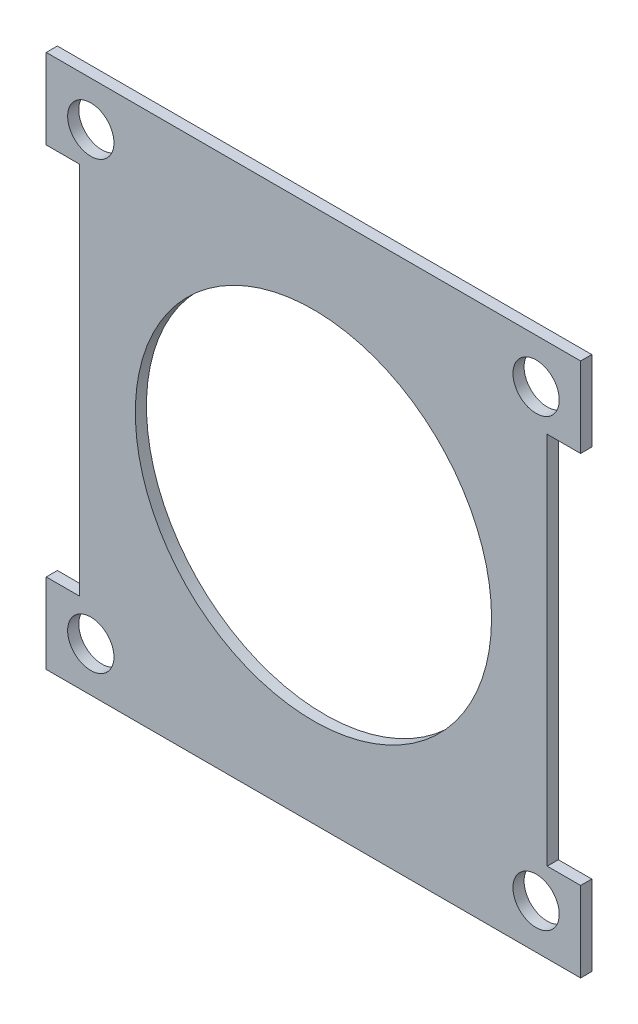
ISO-10303-21;
HEADER;
FILE_DESCRIPTION(('STEP AP214'),'2;1');
FILE_NAME('part.step','',(''),(''),'','','');
FILE_SCHEMA(('AUTOMOTIVE_DESIGN { 1 0 10303 214 1 1 1 1 }'));
ENDSEC;
DATA;
#1=APPLICATION_CONTEXT('core data for automotive mechanical design processes');
#2=APPLICATION_PROTOCOL_DEFINITION('international standard','automotive_design',2000,#1);
#3=PRODUCT_CONTEXT('',#1,'mechanical');
#4=PRODUCT('Part','Part','',(#3));
#5=PRODUCT_RELATED_PRODUCT_CATEGORY('part','',(#4));
#6=PRODUCT_DEFINITION_FORMATION('','',#4);
#7=PRODUCT_DEFINITION_CONTEXT('part definition',#1,'design');
#8=PRODUCT_DEFINITION('design','',#6,#7);
#9=PRODUCT_DEFINITION_SHAPE('','',#8);
#10=(LENGTH_UNIT() NAMED_UNIT(*) SI_UNIT(.MILLI.,.METRE.));
#11=(NAMED_UNIT(*) PLANE_ANGLE_UNIT() SI_UNIT($,.RADIAN.));
#12=(NAMED_UNIT(*) SI_UNIT($,.STERADIAN.) SOLID_ANGLE_UNIT());
#13=UNCERTAINTY_MEASURE_WITH_UNIT(LENGTH_MEASURE(1.E-05),#10,'distance_accuracy_value','');
#14=(GEOMETRIC_REPRESENTATION_CONTEXT(3) GLOBAL_UNCERTAINTY_ASSIGNED_CONTEXT((#13)) GLOBAL_UNIT_ASSIGNED_CONTEXT((#10,
#11,#12)) REPRESENTATION_CONTEXT('',''));
#15=CARTESIAN_POINT('',(0.,0.,0.));
#16=DIRECTION('',(0.,0.,1.));
#17=DIRECTION('',(1.,0.,0.));
#18=AXIS2_PLACEMENT_3D('',#15,#16,#17);
#19=CARTESIAN_POINT('',(0.,0.,1.5875));
#20=DIRECTION('',(0.,0.,1.));
#21=DIRECTION('',(1.,0.,0.));
#22=AXIS2_PLACEMENT_3D('',#19,#20,#21);
#23=PLANE('',#22);
#24=CARTESIAN_POINT('',(-31.75,-31.7499999999996,1.5875));
#25=DIRECTION('',(0.,0.,-1.));
#26=DIRECTION('',(1.,0.,0.));
#27=AXIS2_PLACEMENT_3D('',#24,#25,#26);
#28=CIRCLE('',#27,3.302);
#29=CARTESIAN_POINT('',(-28.448,-31.7499999999996,1.5875));
#30=VERTEX_POINT('',#29);
#31=EDGE_CURVE('E177',#30,#30,#28,.T.);
#32=ORIENTED_EDGE('',*,*,#31,.T.);
#33=EDGE_LOOP('',(#32));
#34=FACE_BOUND('',#33,.T.);
#35=CARTESIAN_POINT('',(31.75,-31.7499999999996,1.5875));
#36=DIRECTION('',(0.,0.,1.));
#37=DIRECTION('',(-1.,0.,0.));
#38=AXIS2_PLACEMENT_3D('',#35,#36,#37);
#39=CIRCLE('',#38,3.302);
#40=CARTESIAN_POINT('',(28.448,-31.7499999999996,1.5875));
#41=VERTEX_POINT('',#40);
#42=EDGE_CURVE('E185',#41,#41,#39,.T.);
#43=ORIENTED_EDGE('',*,*,#42,.F.);
#44=EDGE_LOOP('',(#43));
#45=FACE_BOUND('',#44,.T.);
#46=CARTESIAN_POINT('',(0.,0.,1.5875));
#47=DIRECTION('',(0.,0.,1.));
#48=DIRECTION('',(1.,0.,0.));
#49=AXIS2_PLACEMENT_3D('',#46,#47,#48);
#50=CIRCLE('',#49,25.4);
#51=CARTESIAN_POINT('',(25.4,0.,1.5875));
#52=VERTEX_POINT('',#51);
#53=EDGE_CURVE('E197',#52,#52,#50,.T.);
#54=ORIENTED_EDGE('',*,*,#53,.F.);
#55=EDGE_LOOP('',(#54));
#56=FACE_BOUND('',#55,.T.);
#57=CARTESIAN_POINT('',(-31.75,31.7499999999996,1.5875));
#58=DIRECTION('',(0.,0.,1.));
#59=DIRECTION('',(1.,0.,0.));
#60=AXIS2_PLACEMENT_3D('',#57,#58,#59);
#61=CIRCLE('',#60,3.302);
#62=CARTESIAN_POINT('',(-28.448,31.7499999999996,1.5875));
#63=VERTEX_POINT('',#62);
#64=EDGE_CURVE('E193',#63,#63,#61,.T.);
#65=ORIENTED_EDGE('',*,*,#64,.F.);
#66=EDGE_LOOP('',(#65));
#67=FACE_BOUND('',#66,.T.);
#68=CARTESIAN_POINT('',(31.75,31.7499999999996,1.5875));
#69=DIRECTION('',(0.,0.,-1.));
#70=DIRECTION('',(-1.,0.,0.));
#71=AXIS2_PLACEMENT_3D('',#68,#69,#70);
#72=CIRCLE('',#71,3.302);
#73=CARTESIAN_POINT('',(28.448,31.7499999999996,1.5875));
#74=VERTEX_POINT('',#73);
#75=EDGE_CURVE('E189',#74,#74,#72,.T.);
#76=ORIENTED_EDGE('',*,*,#75,.T.);
#77=EDGE_LOOP('',(#76));
#78=FACE_BOUND('',#77,.T.);
#79=DIRECTION('',(0.,1.,0.));
#80=VECTOR('',#79,1.);
#81=CARTESIAN_POINT('',(38.1,38.1,1.5875));
#82=LINE('',#81,#80);
#83=CARTESIAN_POINT('',(38.1,-38.1,1.5875));
#84=VERTEX_POINT('',#83);
#85=CARTESIAN_POINT('',(38.1,-26.67,1.5875));
#86=VERTEX_POINT('',#85);
#87=EDGE_CURVE('E211',#84,#86,#82,.T.);
#88=ORIENTED_EDGE('',*,*,#87,.T.);
#89=DIRECTION('',(-1.,0.,0.));
#90=VECTOR('',#89,1.);
#91=CARTESIAN_POINT('',(38.1,-26.67,1.5875));
#92=LINE('',#91,#90);
#93=CARTESIAN_POINT('',(33.3375,-26.67,1.5875));
#94=VERTEX_POINT('',#93);
#95=EDGE_CURVE('E144',#86,#94,#92,.T.);
#96=ORIENTED_EDGE('',*,*,#95,.T.);
#97=DIRECTION('',(0.,1.,0.));
#98=VECTOR('',#97,1.);
#99=CARTESIAN_POINT('',(33.3375,26.67,1.5875));
#100=LINE('',#99,#98);
#101=CARTESIAN_POINT('',(33.3375,26.67,1.5875));
#102=VERTEX_POINT('',#101);
#103=EDGE_CURVE('E147',#94,#102,#100,.T.);
#104=ORIENTED_EDGE('',*,*,#103,.T.);
#105=DIRECTION('',(1.,0.,0.));
#106=VECTOR('',#105,1.);
#107=CARTESIAN_POINT('',(38.1,26.67,1.5875));
#108=LINE('',#107,#106);
#109=CARTESIAN_POINT('',(38.1,26.67,1.5875));
#110=VERTEX_POINT('',#109);
#111=EDGE_CURVE('E136',#102,#110,#108,.T.);
#112=ORIENTED_EDGE('',*,*,#111,.T.);
#113=CARTESIAN_POINT('',(38.1,38.1,1.5875));
#114=VERTEX_POINT('',#113);
#115=EDGE_CURVE('E210',#110,#114,#82,.T.);
#116=ORIENTED_EDGE('',*,*,#115,.T.);
#117=DIRECTION('',(-1.,0.,0.));
#118=VECTOR('',#117,1.);
#119=CARTESIAN_POINT('',(-38.1,38.1,1.5875));
#120=LINE('',#119,#118);
#121=CARTESIAN_POINT('',(-38.1,38.1,1.5875));
#122=VERTEX_POINT('',#121);
#123=EDGE_CURVE('E214',#114,#122,#120,.T.);
#124=ORIENTED_EDGE('',*,*,#123,.T.);
#125=DIRECTION('',(0.,-1.,0.));
#126=VECTOR('',#125,1.);
#127=CARTESIAN_POINT('',(-38.1,38.1,1.5875));
#128=LINE('',#127,#126);
#129=CARTESIAN_POINT('',(-38.1,26.67,1.5875));
#130=VERTEX_POINT('',#129);
#131=EDGE_CURVE('E204',#122,#130,#128,.T.);
#132=ORIENTED_EDGE('',*,*,#131,.T.);
#133=DIRECTION('',(-1.,0.,0.));
#134=VECTOR('',#133,1.);
#135=CARTESIAN_POINT('',(-38.1,26.67,1.5875));
#136=LINE('',#135,#134);
#137=CARTESIAN_POINT('',(-33.3375,26.67,1.5875));
#138=VERTEX_POINT('',#137);
#139=EDGE_CURVE('E161',#138,#130,#136,.T.);
#140=ORIENTED_EDGE('',*,*,#139,.F.);
#141=DIRECTION('',(0.,1.,0.));
#142=VECTOR('',#141,1.);
#143=CARTESIAN_POINT('',(-33.3375,26.67,1.5875));
#144=LINE('',#143,#142);
#145=CARTESIAN_POINT('',(-33.3375,-26.67,1.5875));
#146=VERTEX_POINT('',#145);
#147=EDGE_CURVE('E170',#146,#138,#144,.T.);
#148=ORIENTED_EDGE('',*,*,#147,.F.);
#149=DIRECTION('',(1.,0.,0.));
#150=VECTOR('',#149,1.);
#151=CARTESIAN_POINT('',(-38.1,-26.67,1.5875));
#152=LINE('',#151,#150);
#153=CARTESIAN_POINT('',(-38.1,-26.67,1.5875));
#154=VERTEX_POINT('',#153);
#155=EDGE_CURVE('E156',#154,#146,#152,.T.);
#156=ORIENTED_EDGE('',*,*,#155,.F.);
#157=CARTESIAN_POINT('',(-38.1,-38.1,1.5875));
#158=VERTEX_POINT('',#157);
#159=EDGE_CURVE('E208',#154,#158,#128,.T.);
#160=ORIENTED_EDGE('',*,*,#159,.T.);
#161=DIRECTION('',(1.,0.,0.));
#162=VECTOR('',#161,1.);
#163=CARTESIAN_POINT('',(-38.1,-38.1,1.5875));
#164=LINE('',#163,#162);
#165=EDGE_CURVE('E207',#158,#84,#164,.T.);
#166=ORIENTED_EDGE('',*,*,#165,.T.);
#167=EDGE_LOOP('',(#88,#96,#104,#112,#116,#124,#132,#140,#148,#156,#160,#166));
#168=FACE_BOUND('',#167,.T.);
#169=ADVANCED_FACE('F32',(#34,#45,#56,#67,#78,#168),#23,.T.);
#170=CARTESIAN_POINT('',(0.,0.,0.));
#171=DIRECTION('',(0.,0.,1.));
#172=DIRECTION('',(1.,0.,0.));
#173=AXIS2_PLACEMENT_3D('',#170,#171,#172);
#174=PLANE('',#173);
#175=CARTESIAN_POINT('',(-31.75,-31.7499999999996,0.));
#176=DIRECTION('',(0.,0.,1.));
#177=DIRECTION('',(1.,0.,0.));
#178=AXIS2_PLACEMENT_3D('',#175,#176,#177);
#179=CIRCLE('',#178,3.302);
#180=CARTESIAN_POINT('',(-28.448,-31.7499999999996,0.));
#181=VERTEX_POINT('',#180);
#182=EDGE_CURVE('E36',#181,#181,#179,.F.);
#183=ORIENTED_EDGE('',*,*,#182,.F.);
#184=EDGE_LOOP('',(#183));
#185=FACE_BOUND('',#184,.T.);
#186=CARTESIAN_POINT('',(31.75,-31.7499999999996,0.));
#187=DIRECTION('',(0.,0.,1.));
#188=DIRECTION('',(1.,0.,0.));
#189=AXIS2_PLACEMENT_3D('',#186,#187,#188);
#190=CIRCLE('',#189,3.302);
#191=CARTESIAN_POINT('',(35.052,-31.7499999999996,0.));
#192=VERTEX_POINT('',#191);
#193=EDGE_CURVE('E188',#192,#192,#190,.T.);
#194=ORIENTED_EDGE('',*,*,#193,.T.);
#195=EDGE_LOOP('',(#194));
#196=FACE_BOUND('',#195,.T.);
#197=CARTESIAN_POINT('',(0.,0.,0.));
#198=DIRECTION('',(0.,0.,1.));
#199=DIRECTION('',(1.,0.,0.));
#200=AXIS2_PLACEMENT_3D('',#197,#198,#199);
#201=CIRCLE('',#200,25.4);
#202=CARTESIAN_POINT('',(25.4,0.,0.));
#203=VERTEX_POINT('',#202);
#204=EDGE_CURVE('E201',#203,#203,#201,.T.);
#205=ORIENTED_EDGE('',*,*,#204,.T.);
#206=EDGE_LOOP('',(#205));
#207=FACE_BOUND('',#206,.T.);
#208=CARTESIAN_POINT('',(-31.75,31.7499999999996,0.));
#209=DIRECTION('',(0.,0.,1.));
#210=DIRECTION('',(1.,0.,0.));
#211=AXIS2_PLACEMENT_3D('',#208,#209,#210);
#212=CIRCLE('',#211,3.302);
#213=CARTESIAN_POINT('',(-28.448,31.7499999999996,0.));
#214=VERTEX_POINT('',#213);
#215=EDGE_CURVE('E196',#214,#214,#212,.T.);
#216=ORIENTED_EDGE('',*,*,#215,.T.);
#217=EDGE_LOOP('',(#216));
#218=FACE_BOUND('',#217,.T.);
#219=CARTESIAN_POINT('',(31.75,31.7499999999996,0.));
#220=DIRECTION('',(0.,0.,1.));
#221=DIRECTION('',(1.,0.,0.));
#222=AXIS2_PLACEMENT_3D('',#219,#220,#221);
#223=CIRCLE('',#222,3.302);
#224=CARTESIAN_POINT('',(35.052,31.7499999999996,0.));
#225=VERTEX_POINT('',#224);
#226=EDGE_CURVE('E192',#225,#225,#223,.F.);
#227=ORIENTED_EDGE('',*,*,#226,.F.);
#228=EDGE_LOOP('',(#227));
#229=FACE_BOUND('',#228,.T.);
#230=DIRECTION('',(-1.,0.,0.));
#231=VECTOR('',#230,1.);
#232=CARTESIAN_POINT('',(38.1,-26.67,0.));
#233=LINE('',#232,#231);
#234=CARTESIAN_POINT('',(38.1,-26.67,0.));
#235=VERTEX_POINT('',#234);
#236=CARTESIAN_POINT('',(33.3375,-26.67,0.));
#237=VERTEX_POINT('',#236);
#238=EDGE_CURVE('E132',#235,#237,#233,.T.);
#239=ORIENTED_EDGE('',*,*,#238,.F.);
#240=DIRECTION('',(0.,1.,0.));
#241=VECTOR('',#240,1.);
#242=CARTESIAN_POINT('',(38.1,38.1,0.));
#243=LINE('',#242,#241);
#244=CARTESIAN_POINT('',(38.1,-38.1,0.));
#245=VERTEX_POINT('',#244);
#246=EDGE_CURVE('E222',#245,#235,#243,.T.);
#247=ORIENTED_EDGE('',*,*,#246,.F.);
#248=DIRECTION('',(1.,0.,0.));
#249=VECTOR('',#248,1.);
#250=CARTESIAN_POINT('',(-38.1,-38.1,0.));
#251=LINE('',#250,#249);
#252=CARTESIAN_POINT('',(-38.1,-38.1,0.));
#253=VERTEX_POINT('',#252);
#254=EDGE_CURVE('E220',#253,#245,#251,.T.);
#255=ORIENTED_EDGE('',*,*,#254,.F.);
#256=DIRECTION('',(0.,-1.,0.));
#257=VECTOR('',#256,1.);
#258=CARTESIAN_POINT('',(-38.1,38.1,0.));
#259=LINE('',#258,#257);
#260=CARTESIAN_POINT('',(-38.1,-26.67,0.));
#261=VERTEX_POINT('',#260);
#262=EDGE_CURVE('E200',#261,#253,#259,.T.);
#263=ORIENTED_EDGE('',*,*,#262,.F.);
#264=DIRECTION('',(1.,0.,0.));
#265=VECTOR('',#264,1.);
#266=CARTESIAN_POINT('',(-38.1,-26.67,0.));
#267=LINE('',#266,#265);
#268=CARTESIAN_POINT('',(-33.3375,-26.67,0.));
#269=VERTEX_POINT('',#268);
#270=EDGE_CURVE('E57',#261,#269,#267,.T.);
#271=ORIENTED_EDGE('',*,*,#270,.T.);
#272=DIRECTION('',(0.,1.,0.));
#273=VECTOR('',#272,1.);
#274=CARTESIAN_POINT('',(-33.3375,26.67,0.));
#275=LINE('',#274,#273);
#276=CARTESIAN_POINT('',(-33.3375,26.67,0.));
#277=VERTEX_POINT('',#276);
#278=EDGE_CURVE('E160',#269,#277,#275,.T.);
#279=ORIENTED_EDGE('',*,*,#278,.T.);
#280=DIRECTION('',(-1.,0.,0.));
#281=VECTOR('',#280,1.);
#282=CARTESIAN_POINT('',(-38.1,26.67,0.));
#283=LINE('',#282,#281);
#284=CARTESIAN_POINT('',(-38.1,26.67,0.));
#285=VERTEX_POINT('',#284);
#286=EDGE_CURVE('E164',#277,#285,#283,.T.);
#287=ORIENTED_EDGE('',*,*,#286,.T.);
#288=CARTESIAN_POINT('',(-38.1,38.1,0.));
#289=VERTEX_POINT('',#288);
#290=EDGE_CURVE('E217',#289,#285,#259,.T.);
#291=ORIENTED_EDGE('',*,*,#290,.F.);
#292=DIRECTION('',(-1.,0.,0.));
#293=VECTOR('',#292,1.);
#294=CARTESIAN_POINT('',(-38.1,38.1,0.));
#295=LINE('',#294,#293);
#296=CARTESIAN_POINT('',(38.1,38.1,0.));
#297=VERTEX_POINT('',#296);
#298=EDGE_CURVE('E225',#297,#289,#295,.T.);
#299=ORIENTED_EDGE('',*,*,#298,.F.);
#300=CARTESIAN_POINT('',(38.1,26.67,0.));
#301=VERTEX_POINT('',#300);
#302=EDGE_CURVE('E143',#301,#297,#243,.T.);
#303=ORIENTED_EDGE('',*,*,#302,.F.);
#304=DIRECTION('',(1.,0.,0.));
#305=VECTOR('',#304,1.);
#306=CARTESIAN_POINT('',(38.1,26.67,0.));
#307=LINE('',#306,#305);
#308=CARTESIAN_POINT('',(33.3375,26.67,0.));
#309=VERTEX_POINT('',#308);
#310=EDGE_CURVE('E49',#309,#301,#307,.T.);
#311=ORIENTED_EDGE('',*,*,#310,.F.);
#312=DIRECTION('',(0.,1.,0.));
#313=VECTOR('',#312,1.);
#314=CARTESIAN_POINT('',(33.3375,26.67,0.));
#315=LINE('',#314,#313);
#316=EDGE_CURVE('E124',#237,#309,#315,.T.);
#317=ORIENTED_EDGE('',*,*,#316,.F.);
#318=EDGE_LOOP('',(#239,#247,#255,#263,#271,#279,#287,#291,#299,#303,#311,#317));
#319=FACE_BOUND('',#318,.T.);
#320=ADVANCED_FACE('F141',(#185,#196,#207,#218,#229,#319),#174,.F.);
#321=CARTESIAN_POINT('',(38.1,38.1,1.5875));
#322=DIRECTION('',(-1.,0.,0.));
#323=DIRECTION('',(0.,-1.,0.));
#324=AXIS2_PLACEMENT_3D('',#321,#322,#323);
#325=PLANE('',#324);
#326=DIRECTION('',(0.,0.,1.));
#327=VECTOR('',#326,1.);
#328=CARTESIAN_POINT('',(38.1,-26.67,0.));
#329=LINE('',#328,#327);
#330=EDGE_CURVE('E153',#235,#86,#329,.T.);
#331=ORIENTED_EDGE('',*,*,#330,.T.);
#332=ORIENTED_EDGE('',*,*,#87,.F.);
#333=DIRECTION('',(0.,0.,-1.));
#334=VECTOR('',#333,1.);
#335=CARTESIAN_POINT('',(38.1,-38.1,1.5875));
#336=LINE('',#335,#334);
#337=EDGE_CURVE('E41',#84,#245,#336,.T.);
#338=ORIENTED_EDGE('',*,*,#337,.T.);
#339=ORIENTED_EDGE('',*,*,#246,.T.);
#340=EDGE_LOOP('',(#331,#332,#338,#339));
#341=FACE_BOUND('',#340,.T.);
#342=ADVANCED_FACE('F264',(#341),#325,.F.);
#343=DIRECTION('',(0.,0.,1.));
#344=VECTOR('',#343,1.);
#345=CARTESIAN_POINT('',(38.1,26.67,0.));
#346=LINE('',#345,#344);
#347=EDGE_CURVE('E138',#301,#110,#346,.T.);
#348=ORIENTED_EDGE('',*,*,#347,.F.);
#349=ORIENTED_EDGE('',*,*,#302,.T.);
#350=DIRECTION('',(0.,0.,-1.));
#351=VECTOR('',#350,1.);
#352=CARTESIAN_POINT('',(38.1,38.1,1.5875));
#353=LINE('',#352,#351);
#354=EDGE_CURVE('E229',#114,#297,#353,.T.);
#355=ORIENTED_EDGE('',*,*,#354,.F.);
#356=ORIENTED_EDGE('',*,*,#115,.F.);
#357=EDGE_LOOP('',(#348,#349,#355,#356));
#358=FACE_BOUND('',#357,.T.);
#359=ADVANCED_FACE('F278',(#358),#325,.F.);
#360=CARTESIAN_POINT('',(-38.1,38.1,1.5875));
#361=DIRECTION('',(1.,0.,0.));
#362=DIRECTION('',(0.,1.,0.));
#363=AXIS2_PLACEMENT_3D('',#360,#361,#362);
#364=PLANE('',#363);
#365=ORIENTED_EDGE('',*,*,#290,.T.);
#366=DIRECTION('',(0.,0.,1.));
#367=VECTOR('',#366,1.);
#368=CARTESIAN_POINT('',(-38.1,26.67,0.));
#369=LINE('',#368,#367);
#370=EDGE_CURVE('E174',#285,#130,#369,.T.);
#371=ORIENTED_EDGE('',*,*,#370,.T.);
#372=ORIENTED_EDGE('',*,*,#131,.F.);
#373=DIRECTION('',(0.,0.,-1.));
#374=VECTOR('',#373,1.);
#375=CARTESIAN_POINT('',(-38.1,38.1,1.5875));
#376=LINE('',#375,#374);
#377=EDGE_CURVE('E216',#122,#289,#376,.T.);
#378=ORIENTED_EDGE('',*,*,#377,.T.);
#379=EDGE_LOOP('',(#365,#371,#372,#378));
#380=FACE_BOUND('',#379,.T.);
#381=ADVANCED_FACE('F285',(#380),#364,.F.);
#382=ORIENTED_EDGE('',*,*,#159,.F.);
#383=DIRECTION('',(0.,0.,1.));
#384=VECTOR('',#383,1.);
#385=CARTESIAN_POINT('',(-38.1,-26.67,0.));
#386=LINE('',#385,#384);
#387=EDGE_CURVE('E167',#261,#154,#386,.T.);
#388=ORIENTED_EDGE('',*,*,#387,.F.);
#389=ORIENTED_EDGE('',*,*,#262,.T.);
#390=DIRECTION('',(0.,0.,-1.));
#391=VECTOR('',#390,1.);
#392=CARTESIAN_POINT('',(-38.1,-38.1,1.5875));
#393=LINE('',#392,#391);
#394=EDGE_CURVE('E11',#158,#253,#393,.T.);
#395=ORIENTED_EDGE('',*,*,#394,.F.);
#396=EDGE_LOOP('',(#382,#388,#389,#395));
#397=FACE_BOUND('',#396,.T.);
#398=ADVANCED_FACE('F34',(#397),#364,.F.);
#399=CARTESIAN_POINT('',(-38.1,-38.1,1.5875));
#400=DIRECTION('',(0.,1.,0.));
#401=DIRECTION('',(0.,0.,1.));
#402=AXIS2_PLACEMENT_3D('',#399,#400,#401);
#403=PLANE('',#402);
#404=ORIENTED_EDGE('',*,*,#254,.T.);
#405=ORIENTED_EDGE('',*,*,#337,.F.);
#406=ORIENTED_EDGE('',*,*,#165,.F.);
#407=ORIENTED_EDGE('',*,*,#394,.T.);
#408=EDGE_LOOP('',(#404,#405,#406,#407));
#409=FACE_BOUND('',#408,.T.);
#410=ADVANCED_FACE('F275',(#409),#403,.F.);
#411=CARTESIAN_POINT('',(-38.1,38.1,1.5875));
#412=DIRECTION('',(0.,-1.,0.));
#413=DIRECTION('',(1.,0.,0.));
#414=AXIS2_PLACEMENT_3D('',#411,#412,#413);
#415=PLANE('',#414);
#416=ORIENTED_EDGE('',*,*,#298,.T.);
#417=ORIENTED_EDGE('',*,*,#377,.F.);
#418=ORIENTED_EDGE('',*,*,#123,.F.);
#419=ORIENTED_EDGE('',*,*,#354,.T.);
#420=EDGE_LOOP('',(#416,#417,#418,#419));
#421=FACE_BOUND('',#420,.T.);
#422=ADVANCED_FACE('F272',(#421),#415,.F.);
#423=CARTESIAN_POINT('',(0.,0.,1.5875));
#424=DIRECTION('',(0.,0.,-1.));
#425=DIRECTION('',(-1.,0.,0.));
#426=AXIS2_PLACEMENT_3D('',#423,#424,#425);
#427=CYLINDRICAL_SURFACE('',#426,25.4);
#428=ORIENTED_EDGE('',*,*,#53,.T.);
#429=EDGE_LOOP('',(#428));
#430=FACE_BOUND('',#429,.T.);
#431=ORIENTED_EDGE('',*,*,#204,.F.);
#432=EDGE_LOOP('',(#431));
#433=FACE_BOUND('',#432,.T.);
#434=ADVANCED_FACE('F269',(#430,#433),#427,.F.);
#435=CARTESIAN_POINT('',(-31.75,31.7499999999996,-1.5875));
#436=DIRECTION('',(0.,0.,1.));
#437=DIRECTION('',(1.,0.,0.));
#438=AXIS2_PLACEMENT_3D('',#435,#436,#437);
#439=CYLINDRICAL_SURFACE('',#438,3.302);
#440=ORIENTED_EDGE('',*,*,#64,.T.);
#441=EDGE_LOOP('',(#440));
#442=FACE_BOUND('',#441,.T.);
#443=ORIENTED_EDGE('',*,*,#215,.F.);
#444=EDGE_LOOP('',(#443));
#445=FACE_BOUND('',#444,.T.);
#446=ADVANCED_FACE('F255',(#442,#445),#439,.F.);
#447=CARTESIAN_POINT('',(31.75,31.7499999999996,-1.5875));
#448=DIRECTION('',(0.,0.,1.));
#449=DIRECTION('',(1.,0.,0.));
#450=AXIS2_PLACEMENT_3D('',#447,#448,#449);
#451=CYLINDRICAL_SURFACE('',#450,3.302);
#452=ORIENTED_EDGE('',*,*,#75,.F.);
#453=EDGE_LOOP('',(#452));
#454=FACE_BOUND('',#453,.T.);
#455=ORIENTED_EDGE('',*,*,#226,.T.);
#456=EDGE_LOOP('',(#455));
#457=FACE_BOUND('',#456,.T.);
#458=ADVANCED_FACE('F245',(#454,#457),#451,.F.);
#459=CARTESIAN_POINT('',(31.75,-31.7499999999996,-1.5875));
#460=DIRECTION('',(0.,0.,1.));
#461=DIRECTION('',(1.,0.,0.));
#462=AXIS2_PLACEMENT_3D('',#459,#460,#461);
#463=CYLINDRICAL_SURFACE('',#462,3.302);
#464=ORIENTED_EDGE('',*,*,#42,.T.);
#465=EDGE_LOOP('',(#464));
#466=FACE_BOUND('',#465,.T.);
#467=ORIENTED_EDGE('',*,*,#193,.F.);
#468=EDGE_LOOP('',(#467));
#469=FACE_BOUND('',#468,.T.);
#470=ADVANCED_FACE('F242',(#466,#469),#463,.F.);
#471=CARTESIAN_POINT('',(-31.75,-31.7499999999996,-1.5875));
#472=DIRECTION('',(0.,0.,1.));
#473=DIRECTION('',(1.,0.,0.));
#474=AXIS2_PLACEMENT_3D('',#471,#472,#473);
#475=CYLINDRICAL_SURFACE('',#474,3.302);
#476=ORIENTED_EDGE('',*,*,#31,.F.);
#477=EDGE_LOOP('',(#476));
#478=FACE_BOUND('',#477,.T.);
#479=ORIENTED_EDGE('',*,*,#182,.T.);
#480=EDGE_LOOP('',(#479));
#481=FACE_BOUND('',#480,.T.);
#482=ADVANCED_FACE('F244',(#478,#481),#475,.F.);
#483=CARTESIAN_POINT('',(-38.1,26.67,0.));
#484=DIRECTION('',(0.,1.,0.));
#485=DIRECTION('',(0.,0.,1.));
#486=AXIS2_PLACEMENT_3D('',#483,#484,#485);
#487=PLANE('',#486);
#488=ORIENTED_EDGE('',*,*,#139,.T.);
#489=ORIENTED_EDGE('',*,*,#370,.F.);
#490=ORIENTED_EDGE('',*,*,#286,.F.);
#491=DIRECTION('',(0.,0.,1.));
#492=VECTOR('',#491,1.);
#493=CARTESIAN_POINT('',(-33.3375,26.67,0.));
#494=LINE('',#493,#492);
#495=EDGE_CURVE('E178',#277,#138,#494,.T.);
#496=ORIENTED_EDGE('',*,*,#495,.T.);
#497=EDGE_LOOP('',(#488,#489,#490,#496));
#498=FACE_BOUND('',#497,.T.);
#499=ADVANCED_FACE('F252',(#498),#487,.F.);
#500=CARTESIAN_POINT('',(-33.3375,26.67,0.));
#501=DIRECTION('',(1.,0.,0.));
#502=DIRECTION('',(0.,0.,-1.));
#503=AXIS2_PLACEMENT_3D('',#500,#501,#502);
#504=PLANE('',#503);
#505=ORIENTED_EDGE('',*,*,#147,.T.);
#506=ORIENTED_EDGE('',*,*,#495,.F.);
#507=ORIENTED_EDGE('',*,*,#278,.F.);
#508=DIRECTION('',(0.,0.,1.));
#509=VECTOR('',#508,1.);
#510=CARTESIAN_POINT('',(-33.3375,-26.67,0.));
#511=LINE('',#510,#509);
#512=EDGE_CURVE('E180',#269,#146,#511,.T.);
#513=ORIENTED_EDGE('',*,*,#512,.T.);
#514=EDGE_LOOP('',(#505,#506,#507,#513));
#515=FACE_BOUND('',#514,.T.);
#516=ADVANCED_FACE('F303',(#515),#504,.F.);
#517=CARTESIAN_POINT('',(-38.1,-26.67,0.));
#518=DIRECTION('',(0.,-1.,0.));
#519=DIRECTION('',(0.,0.,-1.));
#520=AXIS2_PLACEMENT_3D('',#517,#518,#519);
#521=PLANE('',#520);
#522=ORIENTED_EDGE('',*,*,#155,.T.);
#523=ORIENTED_EDGE('',*,*,#512,.F.);
#524=ORIENTED_EDGE('',*,*,#270,.F.);
#525=ORIENTED_EDGE('',*,*,#387,.T.);
#526=EDGE_LOOP('',(#522,#523,#524,#525));
#527=FACE_BOUND('',#526,.T.);
#528=ADVANCED_FACE('F343',(#527),#521,.F.);
#529=CARTESIAN_POINT('',(38.1,-26.67,0.));
#530=DIRECTION('',(0.,1.,0.));
#531=DIRECTION('',(0.,0.,1.));
#532=AXIS2_PLACEMENT_3D('',#529,#530,#531);
#533=PLANE('',#532);
#534=ORIENTED_EDGE('',*,*,#95,.F.);
#535=ORIENTED_EDGE('',*,*,#330,.F.);
#536=ORIENTED_EDGE('',*,*,#238,.T.);
#537=DIRECTION('',(0.,0.,1.));
#538=VECTOR('',#537,1.);
#539=CARTESIAN_POINT('',(33.3375,-26.67,0.));
#540=LINE('',#539,#538);
#541=EDGE_CURVE('E129',#237,#94,#540,.T.);
#542=ORIENTED_EDGE('',*,*,#541,.T.);
#543=EDGE_LOOP('',(#534,#535,#536,#542));
#544=FACE_BOUND('',#543,.T.);
#545=ADVANCED_FACE('F295',(#544),#533,.T.);
#546=CARTESIAN_POINT('',(33.3375,26.67,0.));
#547=DIRECTION('',(1.,0.,0.));
#548=DIRECTION('',(0.,0.,-1.));
#549=AXIS2_PLACEMENT_3D('',#546,#547,#548);
#550=PLANE('',#549);
#551=ORIENTED_EDGE('',*,*,#103,.F.);
#552=ORIENTED_EDGE('',*,*,#541,.F.);
#553=ORIENTED_EDGE('',*,*,#316,.T.);
#554=DIRECTION('',(0.,0.,1.));
#555=VECTOR('',#554,1.);
#556=CARTESIAN_POINT('',(33.3375,26.67,0.));
#557=LINE('',#556,#555);
#558=EDGE_CURVE('E127',#309,#102,#557,.T.);
#559=ORIENTED_EDGE('',*,*,#558,.T.);
#560=EDGE_LOOP('',(#551,#552,#553,#559));
#561=FACE_BOUND('',#560,.T.);
#562=ADVANCED_FACE('F126',(#561),#550,.T.);
#563=CARTESIAN_POINT('',(38.1,26.67,0.));
#564=DIRECTION('',(0.,-1.,0.));
#565=DIRECTION('',(0.,0.,-1.));
#566=AXIS2_PLACEMENT_3D('',#563,#564,#565);
#567=PLANE('',#566);
#568=ORIENTED_EDGE('',*,*,#111,.F.);
#569=ORIENTED_EDGE('',*,*,#558,.F.);
#570=ORIENTED_EDGE('',*,*,#310,.T.);
#571=ORIENTED_EDGE('',*,*,#347,.T.);
#572=EDGE_LOOP('',(#568,#569,#570,#571));
#573=FACE_BOUND('',#572,.T.);
#574=ADVANCED_FACE('F134',(#573),#567,.T.);
#575=CLOSED_SHELL('',(#169,#320,#342,#359,#381,#398,#410,#422,#434,#446,#458,#470,#482,#499,
#516,#528,#545,#562,#574));
#576=MANIFOLD_SOLID_BREP('B2',#575);
#577=ADVANCED_BREP_SHAPE_REPRESENTATION('',(#18,#576),#14);
#578=SHAPE_DEFINITION_REPRESENTATION(#9,#577);
ENDSEC;
END-ISO-10303-21;
